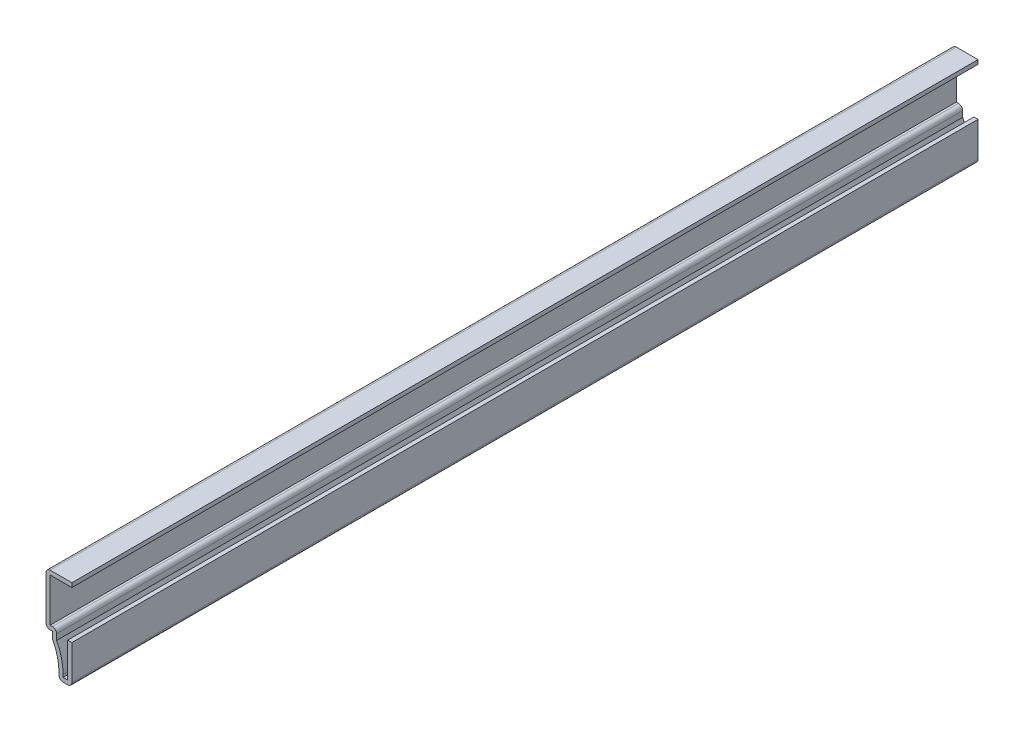
ISO-10303-21;
HEADER;
FILE_DESCRIPTION(('STEP AP214'),'2;1');
FILE_NAME('part.step','',(''),(''),'','','');
FILE_SCHEMA(('AUTOMOTIVE_DESIGN { 1 0 10303 214 1 1 1 1 }'));
ENDSEC;
DATA;
#1=APPLICATION_CONTEXT('core data for automotive mechanical design processes');
#2=APPLICATION_PROTOCOL_DEFINITION('international standard','automotive_design',2000,#1);
#3=PRODUCT_CONTEXT('',#1,'mechanical');
#4=PRODUCT('Part','Part','',(#3));
#5=PRODUCT_RELATED_PRODUCT_CATEGORY('part','',(#4));
#6=PRODUCT_DEFINITION_FORMATION('','',#4);
#7=PRODUCT_DEFINITION_CONTEXT('part definition',#1,'design');
#8=PRODUCT_DEFINITION('design','',#6,#7);
#9=PRODUCT_DEFINITION_SHAPE('','',#8);
#10=(LENGTH_UNIT() NAMED_UNIT(*) SI_UNIT(.MILLI.,.METRE.));
#11=(NAMED_UNIT(*) PLANE_ANGLE_UNIT() SI_UNIT($,.RADIAN.));
#12=(NAMED_UNIT(*) SI_UNIT($,.STERADIAN.) SOLID_ANGLE_UNIT());
#13=UNCERTAINTY_MEASURE_WITH_UNIT(LENGTH_MEASURE(1.E-05),#10,'distance_accuracy_value','');
#14=(GEOMETRIC_REPRESENTATION_CONTEXT(3) GLOBAL_UNCERTAINTY_ASSIGNED_CONTEXT((#13)) GLOBAL_UNIT_ASSIGNED_CONTEXT((#10,
#11,#12)) REPRESENTATION_CONTEXT('',''));
#15=CARTESIAN_POINT('',(0.,0.,0.));
#16=DIRECTION('',(0.,0.,1.));
#17=DIRECTION('',(1.,0.,0.));
#18=AXIS2_PLACEMENT_3D('',#15,#16,#17);
#19=CARTESIAN_POINT('',(-6.34999999999999,11.684,-222.25));
#20=DIRECTION('',(0.,-1.,0.));
#21=DIRECTION('',(0.,0.,-1.));
#22=AXIS2_PLACEMENT_3D('',#19,#20,#21);
#23=PLANE('',#22);
#24=DIRECTION('',(1.,0.,0.));
#25=VECTOR('',#24,1.);
#26=CARTESIAN_POINT('',(-6.34999999999999,11.684,0.));
#27=LINE('',#26,#25);
#28=CARTESIAN_POINT('',(-5.334,11.684,0.));
#29=VERTEX_POINT('',#28);
#30=CARTESIAN_POINT('',(0.,11.684,0.));
#31=VERTEX_POINT('',#30);
#32=EDGE_CURVE('E264',#29,#31,#27,.T.);
#33=ORIENTED_EDGE('',*,*,#32,.F.);
#34=DIRECTION('',(0.,0.,1.));
#35=VECTOR('',#34,1.);
#36=CARTESIAN_POINT('',(-5.334,11.684,-222.25));
#37=LINE('',#36,#35);
#38=CARTESIAN_POINT('',(-5.334,11.684,-222.25));
#39=VERTEX_POINT('',#38);
#40=EDGE_CURVE('E220',#39,#29,#37,.T.);
#41=ORIENTED_EDGE('',*,*,#40,.F.);
#42=DIRECTION('',(1.,0.,0.));
#43=VECTOR('',#42,1.);
#44=CARTESIAN_POINT('',(-6.34999999999999,11.684,-222.25));
#45=LINE('',#44,#43);
#46=CARTESIAN_POINT('',(0.,11.684,-222.25));
#47=VERTEX_POINT('',#46);
#48=EDGE_CURVE('E202',#39,#47,#45,.T.);
#49=ORIENTED_EDGE('',*,*,#48,.T.);
#50=DIRECTION('',(0.,0.,1.));
#51=VECTOR('',#50,1.);
#52=CARTESIAN_POINT('',(0.,11.684,-222.25));
#53=LINE('',#52,#51);
#54=EDGE_CURVE('E210',#47,#31,#53,.T.);
#55=ORIENTED_EDGE('',*,*,#54,.T.);
#56=EDGE_LOOP('',(#33,#41,#49,#55));
#57=FACE_BOUND('',#56,.T.);
#58=ADVANCED_FACE('F35',(#57),#23,.T.);
#59=CARTESIAN_POINT('',(-5.334,0.,-222.25));
#60=DIRECTION('',(1.,0.,0.));
#61=DIRECTION('',(0.,0.,-1.));
#62=AXIS2_PLACEMENT_3D('',#59,#60,#61);
#63=PLANE('',#62);
#64=DIRECTION('',(0.,1.,0.));
#65=VECTOR('',#64,1.);
#66=CARTESIAN_POINT('',(-5.334,0.,0.));
#67=LINE('',#66,#65);
#68=CARTESIAN_POINT('',(-5.334,1.016,0.));
#69=VERTEX_POINT('',#68);
#70=EDGE_CURVE('E221',#69,#29,#67,.T.);
#71=ORIENTED_EDGE('',*,*,#70,.F.);
#72=DIRECTION('',(0.,0.,1.));
#73=VECTOR('',#72,1.);
#74=CARTESIAN_POINT('',(-5.334,1.016,-222.25));
#75=LINE('',#74,#73);
#76=CARTESIAN_POINT('',(-5.334,1.016,-222.25));
#77=VERTEX_POINT('',#76);
#78=EDGE_CURVE('E308',#77,#69,#75,.T.);
#79=ORIENTED_EDGE('',*,*,#78,.F.);
#80=DIRECTION('',(0.,1.,0.));
#81=VECTOR('',#80,1.);
#82=CARTESIAN_POINT('',(-5.334,0.,-222.25));
#83=LINE('',#82,#81);
#84=EDGE_CURVE('E218',#77,#39,#83,.T.);
#85=ORIENTED_EDGE('',*,*,#84,.T.);
#86=ORIENTED_EDGE('',*,*,#40,.T.);
#87=EDGE_LOOP('',(#71,#79,#85,#86));
#88=FACE_BOUND('',#87,.T.);
#89=ADVANCED_FACE('F438',(#88),#63,.T.);
#90=CARTESIAN_POINT('',(-4.7625,1.016,-222.25));
#91=DIRECTION('',(0.,1.,0.));
#92=DIRECTION('',(-1.,0.,0.));
#93=AXIS2_PLACEMENT_3D('',#90,#91,#92);
#94=PLANE('',#93);
#95=DIRECTION('',(-1.,0.,0.));
#96=VECTOR('',#95,1.);
#97=CARTESIAN_POINT('',(-4.7625,1.016,0.));
#98=LINE('',#97,#96);
#99=CARTESIAN_POINT('',(-4.7625,1.016,0.));
#100=VERTEX_POINT('',#99);
#101=EDGE_CURVE('E224',#100,#69,#98,.T.);
#102=ORIENTED_EDGE('',*,*,#101,.F.);
#103=DIRECTION('',(0.,0.,1.));
#104=VECTOR('',#103,1.);
#105=CARTESIAN_POINT('',(-4.7625,1.016,-222.25));
#106=LINE('',#105,#104);
#107=CARTESIAN_POINT('',(-4.7625,1.016,-222.25));
#108=VERTEX_POINT('',#107);
#109=EDGE_CURVE('E362',#100,#108,#106,.F.);
#110=ORIENTED_EDGE('',*,*,#109,.T.);
#111=DIRECTION('',(-1.,0.,0.));
#112=VECTOR('',#111,1.);
#113=CARTESIAN_POINT('',(-4.7625,1.016,-222.25));
#114=LINE('',#113,#112);
#115=EDGE_CURVE('E261',#108,#77,#114,.T.);
#116=ORIENTED_EDGE('',*,*,#115,.T.);
#117=ORIENTED_EDGE('',*,*,#78,.T.);
#118=EDGE_LOOP('',(#102,#110,#116,#117));
#119=FACE_BOUND('',#118,.T.);
#120=ADVANCED_FACE('F481',(#119),#94,.T.);
#121=CARTESIAN_POINT('',(-3.7465,-1.68831946894786,-222.25));
#122=DIRECTION('',(1.,0.,0.));
#123=DIRECTION('',(0.,0.,-1.));
#124=AXIS2_PLACEMENT_3D('',#121,#122,#123);
#125=PLANE('',#124);
#126=DIRECTION('',(0.,1.,0.));
#127=VECTOR('',#126,1.);
#128=CARTESIAN_POINT('',(-3.7465,-1.68831946894786,-222.25));
#129=LINE('',#128,#127);
#130=CARTESIAN_POINT('',(-3.7465,-1.43135901297047,-222.25));
#131=VERTEX_POINT('',#130);
#132=CARTESIAN_POINT('',(-3.7465,0.,-222.25));
#133=VERTEX_POINT('',#132);
#134=EDGE_CURVE('E258',#131,#133,#129,.T.);
#135=ORIENTED_EDGE('',*,*,#134,.T.);
#136=DIRECTION('',(0.,0.,1.));
#137=VECTOR('',#136,1.);
#138=CARTESIAN_POINT('',(-3.7465,0.,-222.25));
#139=LINE('',#138,#137);
#140=CARTESIAN_POINT('',(-3.7465,0.,0.));
#141=VERTEX_POINT('',#140);
#142=EDGE_CURVE('E359',#133,#141,#139,.T.);
#143=ORIENTED_EDGE('',*,*,#142,.T.);
#144=DIRECTION('',(0.,1.,0.));
#145=VECTOR('',#144,1.);
#146=CARTESIAN_POINT('',(-3.7465,-1.68831946894786,0.));
#147=LINE('',#146,#145);
#148=CARTESIAN_POINT('',(-3.7465,-1.43135901297047,0.));
#149=VERTEX_POINT('',#148);
#150=EDGE_CURVE('E302',#149,#141,#147,.T.);
#151=ORIENTED_EDGE('',*,*,#150,.F.);
#152=DIRECTION('',(0.,0.,1.));
#153=VECTOR('',#152,1.);
#154=CARTESIAN_POINT('',(-3.7465,-1.43135901297047,-222.25));
#155=LINE('',#154,#153);
#156=EDGE_CURVE('E311',#131,#149,#155,.T.);
#157=ORIENTED_EDGE('',*,*,#156,.F.);
#158=EDGE_LOOP('',(#135,#143,#151,#157));
#159=FACE_BOUND('',#158,.T.);
#160=ADVANCED_FACE('F449',(#159),#125,.T.);
#161=CARTESIAN_POINT('',(-15.875,-7.83668053105214,-222.25));
#162=DIRECTION('',(0.,0.,1.));
#163=DIRECTION('',(1.,0.,0.));
#164=AXIS2_PLACEMENT_3D('',#161,#162,#163);
#165=CYLINDRICAL_SURFACE('',#164,13.716);
#166=CARTESIAN_POINT('',(-15.875,-7.83668053105214,0.));
#167=DIRECTION('',(0.,0.,1.));
#168=DIRECTION('',(1.,0.,0.));
#169=AXIS2_PLACEMENT_3D('',#166,#167,#168);
#170=CIRCLE('',#169,13.716);
#171=CARTESIAN_POINT('',(-2.159,-7.83668053105214,0.));
#172=VERTEX_POINT('',#171);
#173=EDGE_CURVE('E299',#172,#149,#170,.T.);
#174=ORIENTED_EDGE('',*,*,#173,.F.);
#175=DIRECTION('',(0.,0.,1.));
#176=VECTOR('',#175,1.);
#177=CARTESIAN_POINT('',(-2.159,-7.83668053105214,-222.25));
#178=LINE('',#177,#176);
#179=CARTESIAN_POINT('',(-2.159,-7.83668053105214,-222.25));
#180=VERTEX_POINT('',#179);
#181=EDGE_CURVE('E313',#180,#172,#178,.T.);
#182=ORIENTED_EDGE('',*,*,#181,.F.);
#183=CARTESIAN_POINT('',(-15.875,-7.83668053105214,-222.25));
#184=DIRECTION('',(0.,0.,1.));
#185=DIRECTION('',(1.,0.,0.));
#186=AXIS2_PLACEMENT_3D('',#183,#184,#185);
#187=CIRCLE('',#186,13.716);
#188=EDGE_CURVE('E255',#180,#131,#187,.T.);
#189=ORIENTED_EDGE('',*,*,#188,.T.);
#190=ORIENTED_EDGE('',*,*,#156,.T.);
#191=EDGE_LOOP('',(#174,#182,#189,#190));
#192=FACE_BOUND('',#191,.T.);
#193=ADVANCED_FACE('F453',(#192),#165,.T.);
#194=CARTESIAN_POINT('',(-2.159,-9.525,-222.25));
#195=DIRECTION('',(1.,0.,0.));
#196=DIRECTION('',(0.,0.,-1.));
#197=AXIS2_PLACEMENT_3D('',#194,#195,#196);
#198=PLANE('',#197);
#199=DIRECTION('',(0.,1.,0.));
#200=VECTOR('',#199,1.);
#201=CARTESIAN_POINT('',(-2.159,-9.525,0.));
#202=LINE('',#201,#200);
#203=CARTESIAN_POINT('',(-2.159,-8.509,0.));
#204=VERTEX_POINT('',#203);
#205=EDGE_CURVE('E296',#204,#172,#202,.T.);
#206=ORIENTED_EDGE('',*,*,#205,.F.);
#207=DIRECTION('',(0.,0.,1.));
#208=VECTOR('',#207,1.);
#209=CARTESIAN_POINT('',(-2.159,-8.509,-222.25));
#210=LINE('',#209,#208);
#211=CARTESIAN_POINT('',(-2.159,-8.509,-222.25));
#212=VERTEX_POINT('',#211);
#213=EDGE_CURVE('E315',#212,#204,#210,.T.);
#214=ORIENTED_EDGE('',*,*,#213,.F.);
#215=DIRECTION('',(0.,1.,0.));
#216=VECTOR('',#215,1.);
#217=CARTESIAN_POINT('',(-2.159,-9.525,-222.25));
#218=LINE('',#217,#216);
#219=EDGE_CURVE('E252',#212,#180,#218,.T.);
#220=ORIENTED_EDGE('',*,*,#219,.T.);
#221=ORIENTED_EDGE('',*,*,#181,.T.);
#222=EDGE_LOOP('',(#206,#214,#220,#221));
#223=FACE_BOUND('',#222,.T.);
#224=ADVANCED_FACE('F458',(#223),#198,.T.);
#225=CARTESIAN_POINT('',(0.,-8.509,-222.25));
#226=DIRECTION('',(0.,1.,0.));
#227=DIRECTION('',(-1.,0.,0.));
#228=AXIS2_PLACEMENT_3D('',#225,#226,#227);
#229=PLANE('',#228);
#230=DIRECTION('',(-1.,0.,0.));
#231=VECTOR('',#230,1.);
#232=CARTESIAN_POINT('',(0.,-8.509,0.));
#233=LINE('',#232,#231);
#234=CARTESIAN_POINT('',(-1.016,-8.509,0.));
#235=VERTEX_POINT('',#234);
#236=EDGE_CURVE('E293',#235,#204,#233,.T.);
#237=ORIENTED_EDGE('',*,*,#236,.F.);
#238=DIRECTION('',(0.,0.,1.));
#239=VECTOR('',#238,1.);
#240=CARTESIAN_POINT('',(-1.016,-8.509,-222.25));
#241=LINE('',#240,#239);
#242=CARTESIAN_POINT('',(-1.016,-8.509,-222.25));
#243=VERTEX_POINT('',#242);
#244=EDGE_CURVE('E317',#243,#235,#241,.T.);
#245=ORIENTED_EDGE('',*,*,#244,.F.);
#246=DIRECTION('',(-1.,0.,0.));
#247=VECTOR('',#246,1.);
#248=CARTESIAN_POINT('',(0.,-8.509,-222.25));
#249=LINE('',#248,#247);
#250=EDGE_CURVE('E249',#243,#212,#249,.T.);
#251=ORIENTED_EDGE('',*,*,#250,.T.);
#252=ORIENTED_EDGE('',*,*,#213,.T.);
#253=EDGE_LOOP('',(#237,#245,#251,#252));
#254=FACE_BOUND('',#253,.T.);
#255=ADVANCED_FACE('F461',(#254),#229,.T.);
#256=CARTESIAN_POINT('',(-1.016,0.,-222.25));
#257=DIRECTION('',(-1.,0.,0.));
#258=DIRECTION('',(0.,0.,1.));
#259=AXIS2_PLACEMENT_3D('',#256,#257,#258);
#260=PLANE('',#259);
#261=DIRECTION('',(0.,1.,0.));
#262=VECTOR('',#261,1.);
#263=CARTESIAN_POINT('',(-1.016,0.,0.));
#264=LINE('',#263,#262);
#265=CARTESIAN_POINT('',(-1.016,0.,0.));
#266=VERTEX_POINT('',#265);
#267=EDGE_CURVE('E290',#266,#235,#264,.F.);
#268=ORIENTED_EDGE('',*,*,#267,.F.);
#269=DIRECTION('',(0.,0.,1.));
#270=VECTOR('',#269,1.);
#271=CARTESIAN_POINT('',(-1.016,0.,-222.25));
#272=LINE('',#271,#270);
#273=CARTESIAN_POINT('',(-1.016,0.,-222.25));
#274=VERTEX_POINT('',#273);
#275=EDGE_CURVE('E319',#274,#266,#272,.T.);
#276=ORIENTED_EDGE('',*,*,#275,.F.);
#277=DIRECTION('',(0.,1.,0.));
#278=VECTOR('',#277,1.);
#279=CARTESIAN_POINT('',(-1.016,0.,-222.25));
#280=LINE('',#279,#278);
#281=EDGE_CURVE('E246',#274,#243,#280,.F.);
#282=ORIENTED_EDGE('',*,*,#281,.T.);
#283=ORIENTED_EDGE('',*,*,#244,.T.);
#284=EDGE_LOOP('',(#268,#276,#282,#283));
#285=FACE_BOUND('',#284,.T.);
#286=ADVANCED_FACE('F464',(#285),#260,.T.);
#287=CARTESIAN_POINT('',(-1.016,0.,-222.25));
#288=DIRECTION('',(0.,-1.,0.));
#289=DIRECTION('',(0.,0.,-1.));
#290=AXIS2_PLACEMENT_3D('',#287,#288,#289);
#291=PLANE('',#290);
#292=DIRECTION('',(1.,0.,0.));
#293=VECTOR('',#292,1.);
#294=CARTESIAN_POINT('',(-1.016,0.,0.));
#295=LINE('',#294,#293);
#296=CARTESIAN_POINT('',(0.,0.,0.));
#297=VERTEX_POINT('',#296);
#298=EDGE_CURVE('E288',#266,#297,#295,.T.);
#299=ORIENTED_EDGE('',*,*,#298,.T.);
#300=DIRECTION('',(0.,0.,1.));
#301=VECTOR('',#300,1.);
#302=CARTESIAN_POINT('',(0.,0.,-222.25));
#303=LINE('',#302,#301);
#304=CARTESIAN_POINT('',(0.,0.,-222.25));
#305=VERTEX_POINT('',#304);
#306=EDGE_CURVE('E321',#305,#297,#303,.T.);
#307=ORIENTED_EDGE('',*,*,#306,.F.);
#308=DIRECTION('',(1.,0.,0.));
#309=VECTOR('',#308,1.);
#310=CARTESIAN_POINT('',(-1.016,0.,-222.25));
#311=LINE('',#310,#309);
#312=EDGE_CURVE('E244',#274,#305,#311,.T.);
#313=ORIENTED_EDGE('',*,*,#312,.F.);
#314=ORIENTED_EDGE('',*,*,#275,.T.);
#315=EDGE_LOOP('',(#299,#307,#313,#314));
#316=FACE_BOUND('',#315,.T.);
#317=ADVANCED_FACE('F467',(#316),#291,.F.);
#318=CARTESIAN_POINT('',(0.,0.,-222.25));
#319=DIRECTION('',(-1.,0.,0.));
#320=DIRECTION('',(0.,0.,1.));
#321=AXIS2_PLACEMENT_3D('',#318,#319,#320);
#322=PLANE('',#321);
#323=DIRECTION('',(0.,-1.,0.));
#324=VECTOR('',#323,1.);
#325=CARTESIAN_POINT('',(0.,0.,0.));
#326=LINE('',#325,#324);
#327=CARTESIAN_POINT('',(0.,-8.509,0.));
#328=VERTEX_POINT('',#327);
#329=EDGE_CURVE('E285',#297,#328,#326,.T.);
#330=ORIENTED_EDGE('',*,*,#329,.T.);
#331=DIRECTION('',(0.,0.,1.));
#332=VECTOR('',#331,1.);
#333=CARTESIAN_POINT('',(0.,-8.509,-222.25));
#334=LINE('',#333,#332);
#335=CARTESIAN_POINT('',(0.,-8.509,-222.25));
#336=VERTEX_POINT('',#335);
#337=EDGE_CURVE('E43',#328,#336,#334,.F.);
#338=ORIENTED_EDGE('',*,*,#337,.T.);
#339=DIRECTION('',(0.,-1.,0.));
#340=VECTOR('',#339,1.);
#341=CARTESIAN_POINT('',(0.,0.,-222.25));
#342=LINE('',#341,#340);
#343=EDGE_CURVE('E241',#305,#336,#342,.T.);
#344=ORIENTED_EDGE('',*,*,#343,.F.);
#345=ORIENTED_EDGE('',*,*,#306,.T.);
#346=EDGE_LOOP('',(#330,#338,#344,#345));
#347=FACE_BOUND('',#346,.T.);
#348=ADVANCED_FACE('F379',(#347),#322,.F.);
#349=CARTESIAN_POINT('',(0.,-9.525,-222.25));
#350=DIRECTION('',(0.,1.,0.));
#351=DIRECTION('',(-1.,0.,0.));
#352=AXIS2_PLACEMENT_3D('',#349,#350,#351);
#353=PLANE('',#352);
#354=DIRECTION('',(-1.,0.,0.));
#355=VECTOR('',#354,1.);
#356=CARTESIAN_POINT('',(0.,-9.525,0.));
#357=LINE('',#356,#355);
#358=CARTESIAN_POINT('',(-1.016,-9.525,0.));
#359=VERTEX_POINT('',#358);
#360=CARTESIAN_POINT('',(-2.159,-9.525,0.));
#361=VERTEX_POINT('',#360);
#362=EDGE_CURVE('E282',#359,#361,#357,.T.);
#363=ORIENTED_EDGE('',*,*,#362,.T.);
#364=DIRECTION('',(0.,0.,1.));
#365=VECTOR('',#364,1.);
#366=CARTESIAN_POINT('',(-2.159,-9.525,-222.25));
#367=LINE('',#366,#365);
#368=CARTESIAN_POINT('',(-2.159,-9.525,-222.25));
#369=VERTEX_POINT('',#368);
#370=EDGE_CURVE('E375',#361,#369,#367,.F.);
#371=ORIENTED_EDGE('',*,*,#370,.T.);
#372=DIRECTION('',(-1.,0.,0.));
#373=VECTOR('',#372,1.);
#374=CARTESIAN_POINT('',(0.,-9.525,-222.25));
#375=LINE('',#374,#373);
#376=CARTESIAN_POINT('',(-1.016,-9.525,-222.25));
#377=VERTEX_POINT('',#376);
#378=EDGE_CURVE('E238',#377,#369,#375,.T.);
#379=ORIENTED_EDGE('',*,*,#378,.F.);
#380=DIRECTION('',(0.,0.,1.));
#381=VECTOR('',#380,1.);
#382=CARTESIAN_POINT('',(-1.016,-9.525,-222.25));
#383=LINE('',#382,#381);
#384=EDGE_CURVE('E372',#377,#359,#383,.T.);
#385=ORIENTED_EDGE('',*,*,#384,.T.);
#386=EDGE_LOOP('',(#363,#371,#379,#385));
#387=FACE_BOUND('',#386,.T.);
#388=ADVANCED_FACE('F391',(#387),#353,.F.);
#389=CARTESIAN_POINT('',(-3.175,-9.525,-222.25));
#390=DIRECTION('',(1.,0.,0.));
#391=DIRECTION('',(0.,0.,-1.));
#392=AXIS2_PLACEMENT_3D('',#389,#390,#391);
#393=PLANE('',#392);
#394=DIRECTION('',(0.,1.,0.));
#395=VECTOR('',#394,1.);
#396=CARTESIAN_POINT('',(-3.175,-9.525,-222.25));
#397=LINE('',#396,#395);
#398=CARTESIAN_POINT('',(-3.175,-8.509,-222.25));
#399=VERTEX_POINT('',#398);
#400=CARTESIAN_POINT('',(-3.175,-7.83668053105214,-222.25));
#401=VERTEX_POINT('',#400);
#402=EDGE_CURVE('E236',#399,#401,#397,.T.);
#403=ORIENTED_EDGE('',*,*,#402,.F.);
#404=DIRECTION('',(0.,0.,1.));
#405=VECTOR('',#404,1.);
#406=CARTESIAN_POINT('',(-3.175,-8.509,-222.25));
#407=LINE('',#406,#405);
#408=CARTESIAN_POINT('',(-3.175,-8.509,0.));
#409=VERTEX_POINT('',#408);
#410=EDGE_CURVE('E369',#399,#409,#407,.T.);
#411=ORIENTED_EDGE('',*,*,#410,.T.);
#412=DIRECTION('',(0.,1.,0.));
#413=VECTOR('',#412,1.);
#414=CARTESIAN_POINT('',(-3.175,-9.525,0.));
#415=LINE('',#414,#413);
#416=CARTESIAN_POINT('',(-3.175,-7.83668053105214,0.));
#417=VERTEX_POINT('',#416);
#418=EDGE_CURVE('E280',#409,#417,#415,.T.);
#419=ORIENTED_EDGE('',*,*,#418,.T.);
#420=DIRECTION('',(0.,0.,1.));
#421=VECTOR('',#420,1.);
#422=CARTESIAN_POINT('',(-3.175,-7.83668053105214,-222.25));
#423=LINE('',#422,#421);
#424=EDGE_CURVE('E324',#401,#417,#423,.T.);
#425=ORIENTED_EDGE('',*,*,#424,.F.);
#426=EDGE_LOOP('',(#403,#411,#419,#425));
#427=FACE_BOUND('',#426,.T.);
#428=ADVANCED_FACE('F404',(#427),#393,.F.);
#429=CARTESIAN_POINT('',(-15.875,-7.83668053105214,-222.25));
#430=DIRECTION('',(0.,0.,1.));
#431=DIRECTION('',(1.,0.,0.));
#432=AXIS2_PLACEMENT_3D('',#429,#430,#431);
#433=CYLINDRICAL_SURFACE('',#432,12.7);
#434=CARTESIAN_POINT('',(-15.875,-7.83668053105214,0.));
#435=DIRECTION('',(0.,0.,1.));
#436=DIRECTION('',(1.,0.,0.));
#437=AXIS2_PLACEMENT_3D('',#434,#435,#436);
#438=CIRCLE('',#437,12.7);
#439=CARTESIAN_POINT('',(-4.64490740740741,-1.90582727356911,0.));
#440=VERTEX_POINT('',#439);
#441=EDGE_CURVE('E277',#417,#440,#438,.T.);
#442=ORIENTED_EDGE('',*,*,#441,.T.);
#443=DIRECTION('',(0.,0.,1.));
#444=VECTOR('',#443,1.);
#445=CARTESIAN_POINT('',(-4.64490740740741,-1.90582727356911,-222.25));
#446=LINE('',#445,#444);
#447=CARTESIAN_POINT('',(-4.64490740740741,-1.90582727356911,-222.25));
#448=VERTEX_POINT('',#447);
#449=EDGE_CURVE('E367',#440,#448,#446,.F.);
#450=ORIENTED_EDGE('',*,*,#449,.T.);
#451=CARTESIAN_POINT('',(-15.875,-7.83668053105214,-222.25));
#452=DIRECTION('',(0.,0.,1.));
#453=DIRECTION('',(1.,0.,0.));
#454=AXIS2_PLACEMENT_3D('',#451,#452,#453);
#455=CIRCLE('',#454,12.7);
#456=EDGE_CURVE('E234',#401,#448,#455,.T.);
#457=ORIENTED_EDGE('',*,*,#456,.F.);
#458=ORIENTED_EDGE('',*,*,#424,.T.);
#459=EDGE_LOOP('',(#442,#450,#457,#458));
#460=FACE_BOUND('',#459,.T.);
#461=ADVANCED_FACE('F578',(#460),#433,.F.);
#462=CARTESIAN_POINT('',(-4.7625,-1.68831946894786,-222.25));
#463=DIRECTION('',(1.,0.,0.));
#464=DIRECTION('',(0.,0.,-1.));
#465=AXIS2_PLACEMENT_3D('',#462,#463,#464);
#466=PLANE('',#465);
#467=DIRECTION('',(0.,1.,0.));
#468=VECTOR('',#467,1.);
#469=CARTESIAN_POINT('',(-4.7625,-1.68831946894786,-222.25));
#470=LINE('',#469,#468);
#471=CARTESIAN_POINT('',(-4.7625,-1.43135901297047,-222.25));
#472=VERTEX_POINT('',#471);
#473=CARTESIAN_POINT('',(-4.7625,0.,-222.25));
#474=VERTEX_POINT('',#473);
#475=EDGE_CURVE('E232',#472,#474,#470,.T.);
#476=ORIENTED_EDGE('',*,*,#475,.F.);
#477=DIRECTION('',(0.,0.,1.));
#478=VECTOR('',#477,1.);
#479=CARTESIAN_POINT('',(-4.7625,-1.43135901297047,-222.25));
#480=LINE('',#479,#478);
#481=CARTESIAN_POINT('',(-4.7625,-1.43135901297047,0.));
#482=VERTEX_POINT('',#481);
#483=EDGE_CURVE('E364',#472,#482,#480,.T.);
#484=ORIENTED_EDGE('',*,*,#483,.T.);
#485=DIRECTION('',(0.,1.,0.));
#486=VECTOR('',#485,1.);
#487=CARTESIAN_POINT('',(-4.7625,-1.68831946894786,0.));
#488=LINE('',#487,#486);
#489=CARTESIAN_POINT('',(-4.7625,0.,0.));
#490=VERTEX_POINT('',#489);
#491=EDGE_CURVE('E275',#482,#490,#488,.T.);
#492=ORIENTED_EDGE('',*,*,#491,.T.);
#493=DIRECTION('',(0.,0.,1.));
#494=VECTOR('',#493,1.);
#495=CARTESIAN_POINT('',(-4.7625,0.,-222.25));
#496=LINE('',#495,#494);
#497=EDGE_CURVE('E327',#474,#490,#496,.T.);
#498=ORIENTED_EDGE('',*,*,#497,.F.);
#499=EDGE_LOOP('',(#476,#484,#492,#498));
#500=FACE_BOUND('',#499,.T.);
#501=ADVANCED_FACE('F414',(#500),#466,.F.);
#502=CARTESIAN_POINT('',(-4.7625,0.,-222.25));
#503=DIRECTION('',(0.,1.,0.));
#504=DIRECTION('',(-1.,0.,0.));
#505=AXIS2_PLACEMENT_3D('',#502,#503,#504);
#506=PLANE('',#505);
#507=DIRECTION('',(-1.,0.,0.));
#508=VECTOR('',#507,1.);
#509=CARTESIAN_POINT('',(-4.7625,0.,0.));
#510=LINE('',#509,#508);
#511=CARTESIAN_POINT('',(-5.33399999999999,0.,0.));
#512=VERTEX_POINT('',#511);
#513=EDGE_CURVE('E272',#490,#512,#510,.T.);
#514=ORIENTED_EDGE('',*,*,#513,.T.);
#515=DIRECTION('',(0.,0.,1.));
#516=VECTOR('',#515,1.);
#517=CARTESIAN_POINT('',(-5.33399999999999,0.,-222.25));
#518=LINE('',#517,#516);
#519=CARTESIAN_POINT('',(-5.33399999999999,0.,-222.25));
#520=VERTEX_POINT('',#519);
#521=EDGE_CURVE('E347',#512,#520,#518,.F.);
#522=ORIENTED_EDGE('',*,*,#521,.T.);
#523=DIRECTION('',(-1.,0.,0.));
#524=VECTOR('',#523,1.);
#525=CARTESIAN_POINT('',(-4.7625,0.,-222.25));
#526=LINE('',#525,#524);
#527=EDGE_CURVE('E230',#474,#520,#526,.T.);
#528=ORIENTED_EDGE('',*,*,#527,.F.);
#529=ORIENTED_EDGE('',*,*,#497,.T.);
#530=EDGE_LOOP('',(#514,#522,#528,#529));
#531=FACE_BOUND('',#530,.T.);
#532=ADVANCED_FACE('F419',(#531),#506,.F.);
#533=CARTESIAN_POINT('',(-6.34999999999999,0.,-222.25));
#534=DIRECTION('',(1.,0.,0.));
#535=DIRECTION('',(0.,0.,-1.));
#536=AXIS2_PLACEMENT_3D('',#533,#534,#535);
#537=PLANE('',#536);
#538=DIRECTION('',(0.,1.,0.));
#539=VECTOR('',#538,1.);
#540=CARTESIAN_POINT('',(-6.34999999999999,0.,-222.25));
#541=LINE('',#540,#539);
#542=CARTESIAN_POINT('',(-6.34999999999999,1.016,-222.25));
#543=VERTEX_POINT('',#542);
#544=CARTESIAN_POINT('',(-6.34999999999999,11.684,-222.25));
#545=VERTEX_POINT('',#544);
#546=EDGE_CURVE('E228',#543,#545,#541,.T.);
#547=ORIENTED_EDGE('',*,*,#546,.F.);
#548=DIRECTION('',(0.,0.,1.));
#549=VECTOR('',#548,1.);
#550=CARTESIAN_POINT('',(-6.34999999999999,1.016,-222.25));
#551=LINE('',#550,#549);
#552=CARTESIAN_POINT('',(-6.34999999999999,1.016,0.));
#553=VERTEX_POINT('',#552);
#554=EDGE_CURVE('E332',#543,#553,#551,.T.);
#555=ORIENTED_EDGE('',*,*,#554,.T.);
#556=DIRECTION('',(0.,1.,0.));
#557=VECTOR('',#556,1.);
#558=CARTESIAN_POINT('',(-6.34999999999999,0.,0.));
#559=LINE('',#558,#557);
#560=CARTESIAN_POINT('',(-6.34999999999999,11.684,0.));
#561=VERTEX_POINT('',#560);
#562=EDGE_CURVE('E269',#553,#561,#559,.T.);
#563=ORIENTED_EDGE('',*,*,#562,.T.);
#564=DIRECTION('',(0.,0.,1.));
#565=VECTOR('',#564,1.);
#566=CARTESIAN_POINT('',(-6.34999999999999,11.684,-222.25));
#567=LINE('',#566,#565);
#568=EDGE_CURVE('E307',#561,#545,#567,.F.);
#569=ORIENTED_EDGE('',*,*,#568,.T.);
#570=EDGE_LOOP('',(#547,#555,#563,#569));
#571=FACE_BOUND('',#570,.T.);
#572=ADVANCED_FACE('F427',(#571),#537,.F.);
#573=CARTESIAN_POINT('',(-6.34999999999999,12.7,-222.25));
#574=DIRECTION('',(0.,-1.,0.));
#575=DIRECTION('',(0.,0.,-1.));
#576=AXIS2_PLACEMENT_3D('',#573,#574,#575);
#577=PLANE('',#576);
#578=DIRECTION('',(1.,0.,0.));
#579=VECTOR('',#578,1.);
#580=CARTESIAN_POINT('',(-6.34999999999999,12.7,-222.25));
#581=LINE('',#580,#579);
#582=CARTESIAN_POINT('',(-5.334,12.7,-222.25));
#583=VERTEX_POINT('',#582);
#584=CARTESIAN_POINT('',(0.,12.7,-222.25));
#585=VERTEX_POINT('',#584);
#586=EDGE_CURVE('E204',#583,#585,#581,.T.);
#587=ORIENTED_EDGE('',*,*,#586,.F.);
#588=DIRECTION('',(0.,0.,1.));
#589=VECTOR('',#588,1.);
#590=CARTESIAN_POINT('',(-5.334,12.7,-222.25));
#591=LINE('',#590,#589);
#592=CARTESIAN_POINT('',(-5.334,12.7,0.));
#593=VERTEX_POINT('',#592);
#594=EDGE_CURVE('E11',#583,#593,#591,.T.);
#595=ORIENTED_EDGE('',*,*,#594,.T.);
#596=DIRECTION('',(1.,0.,0.));
#597=VECTOR('',#596,1.);
#598=CARTESIAN_POINT('',(-6.34999999999999,12.7,0.));
#599=LINE('',#598,#597);
#600=CARTESIAN_POINT('',(0.,12.7,0.));
#601=VERTEX_POINT('',#600);
#602=EDGE_CURVE('E267',#593,#601,#599,.T.);
#603=ORIENTED_EDGE('',*,*,#602,.T.);
#604=DIRECTION('',(0.,0.,1.));
#605=VECTOR('',#604,1.);
#606=CARTESIAN_POINT('',(0.,12.7,-222.25));
#607=LINE('',#606,#605);
#608=EDGE_CURVE('E217',#585,#601,#607,.T.);
#609=ORIENTED_EDGE('',*,*,#608,.F.);
#610=EDGE_LOOP('',(#587,#595,#603,#609));
#611=FACE_BOUND('',#610,.T.);
#612=ADVANCED_FACE('F433',(#611),#577,.F.);
#613=CARTESIAN_POINT('',(0.,12.7,-222.25));
#614=DIRECTION('',(-1.,0.,0.));
#615=DIRECTION('',(0.,0.,1.));
#616=AXIS2_PLACEMENT_3D('',#613,#614,#615);
#617=PLANE('',#616);
#618=DIRECTION('',(0.,-1.,0.));
#619=VECTOR('',#618,1.);
#620=CARTESIAN_POINT('',(0.,12.7,0.));
#621=LINE('',#620,#619);
#622=EDGE_CURVE('E213',#601,#31,#621,.T.);
#623=ORIENTED_EDGE('',*,*,#622,.T.);
#624=ORIENTED_EDGE('',*,*,#54,.F.);
#625=DIRECTION('',(0.,-1.,0.));
#626=VECTOR('',#625,1.);
#627=CARTESIAN_POINT('',(0.,12.7,-222.25));
#628=LINE('',#627,#626);
#629=EDGE_CURVE('E196',#585,#47,#628,.T.);
#630=ORIENTED_EDGE('',*,*,#629,.F.);
#631=ORIENTED_EDGE('',*,*,#608,.T.);
#632=EDGE_LOOP('',(#623,#624,#630,#631));
#633=FACE_BOUND('',#632,.T.);
#634=ADVANCED_FACE('F211',(#633),#617,.F.);
#635=CARTESIAN_POINT('',(-15.875,-7.83668053105214,-222.25));
#636=DIRECTION('',(0.,0.,1.));
#637=DIRECTION('',(1.,0.,0.));
#638=AXIS2_PLACEMENT_3D('',#635,#636,#637);
#639=PLANE('',#638);
#640=ORIENTED_EDGE('',*,*,#527,.T.);
#641=CARTESIAN_POINT('',(-5.334,1.016,-222.25));
#642=DIRECTION('',(0.,0.,1.));
#643=DIRECTION('',(1.,0.,0.));
#644=AXIS2_PLACEMENT_3D('',#641,#642,#643);
#645=CIRCLE('',#644,1.016);
#646=EDGE_CURVE('E357',#520,#543,#645,.F.);
#647=ORIENTED_EDGE('',*,*,#646,.T.);
#648=ORIENTED_EDGE('',*,*,#546,.T.);
#649=CARTESIAN_POINT('',(-5.334,11.684,-222.25));
#650=DIRECTION('',(0.,0.,1.));
#651=DIRECTION('',(1.,0.,0.));
#652=AXIS2_PLACEMENT_3D('',#649,#650,#651);
#653=CIRCLE('',#652,1.016);
#654=EDGE_CURVE('E50',#545,#583,#653,.F.);
#655=ORIENTED_EDGE('',*,*,#654,.T.);
#656=ORIENTED_EDGE('',*,*,#586,.T.);
#657=ORIENTED_EDGE('',*,*,#629,.T.);
#658=ORIENTED_EDGE('',*,*,#48,.F.);
#659=ORIENTED_EDGE('',*,*,#84,.F.);
#660=ORIENTED_EDGE('',*,*,#115,.F.);
#661=CARTESIAN_POINT('',(-4.7625,0.,-222.25));
#662=DIRECTION('',(0.,0.,1.));
#663=DIRECTION('',(1.,0.,0.));
#664=AXIS2_PLACEMENT_3D('',#661,#662,#663);
#665=CIRCLE('',#664,1.016);
#666=EDGE_CURVE('E355',#108,#133,#665,.F.);
#667=ORIENTED_EDGE('',*,*,#666,.T.);
#668=ORIENTED_EDGE('',*,*,#134,.F.);
#669=ORIENTED_EDGE('',*,*,#188,.F.);
#670=ORIENTED_EDGE('',*,*,#219,.F.);
#671=ORIENTED_EDGE('',*,*,#250,.F.);
#672=ORIENTED_EDGE('',*,*,#281,.F.);
#673=ORIENTED_EDGE('',*,*,#312,.T.);
#674=ORIENTED_EDGE('',*,*,#343,.T.);
#675=CARTESIAN_POINT('',(-1.016,-8.509,-222.25));
#676=DIRECTION('',(0.,0.,1.));
#677=DIRECTION('',(1.,0.,0.));
#678=AXIS2_PLACEMENT_3D('',#675,#676,#677);
#679=CIRCLE('',#678,1.016);
#680=EDGE_CURVE('E350',#336,#377,#679,.F.);
#681=ORIENTED_EDGE('',*,*,#680,.T.);
#682=ORIENTED_EDGE('',*,*,#378,.T.);
#683=CARTESIAN_POINT('',(-2.159,-8.509,-222.25));
#684=DIRECTION('',(0.,0.,1.));
#685=DIRECTION('',(1.,0.,0.));
#686=AXIS2_PLACEMENT_3D('',#683,#684,#685);
#687=CIRCLE('',#686,1.016);
#688=EDGE_CURVE('E352',#369,#399,#687,.F.);
#689=ORIENTED_EDGE('',*,*,#688,.T.);
#690=ORIENTED_EDGE('',*,*,#402,.T.);
#691=ORIENTED_EDGE('',*,*,#456,.T.);
#692=CARTESIAN_POINT('',(-3.7465,-1.43135901297047,-222.25));
#693=DIRECTION('',(0.,0.,1.));
#694=DIRECTION('',(1.,0.,0.));
#695=AXIS2_PLACEMENT_3D('',#692,#693,#694);
#696=CIRCLE('',#695,1.016);
#697=EDGE_CURVE('E57',#448,#472,#696,.F.);
#698=ORIENTED_EDGE('',*,*,#697,.T.);
#699=ORIENTED_EDGE('',*,*,#475,.T.);
#700=EDGE_LOOP('',(#640,#647,#648,#655,#656,#657,#658,#659,#660,#667,#668,#669,#670,#671,#672,
#673,#674,#681,#682,#689,#690,#691,#698,#699));
#701=FACE_BOUND('',#700,.T.);
#702=ADVANCED_FACE('F199',(#701),#639,.F.);
#703=CARTESIAN_POINT('',(-15.875,-7.83668053105214,0.));
#704=DIRECTION('',(0.,0.,1.));
#705=DIRECTION('',(1.,0.,0.));
#706=AXIS2_PLACEMENT_3D('',#703,#704,#705);
#707=PLANE('',#706);
#708=ORIENTED_EDGE('',*,*,#562,.F.);
#709=CARTESIAN_POINT('',(-5.334,1.016,0.));
#710=DIRECTION('',(0.,0.,1.));
#711=DIRECTION('',(1.,0.,0.));
#712=AXIS2_PLACEMENT_3D('',#709,#710,#711);
#713=CIRCLE('',#712,1.016);
#714=EDGE_CURVE('E345',#553,#512,#713,.T.);
#715=ORIENTED_EDGE('',*,*,#714,.T.);
#716=ORIENTED_EDGE('',*,*,#513,.F.);
#717=ORIENTED_EDGE('',*,*,#491,.F.);
#718=CARTESIAN_POINT('',(-3.7465,-1.43135901297047,0.));
#719=DIRECTION('',(0.,0.,1.));
#720=DIRECTION('',(1.,0.,0.));
#721=AXIS2_PLACEMENT_3D('',#718,#719,#720);
#722=CIRCLE('',#721,1.016);
#723=EDGE_CURVE('E341',#482,#440,#722,.T.);
#724=ORIENTED_EDGE('',*,*,#723,.T.);
#725=ORIENTED_EDGE('',*,*,#441,.F.);
#726=ORIENTED_EDGE('',*,*,#418,.F.);
#727=CARTESIAN_POINT('',(-2.159,-8.509,0.));
#728=DIRECTION('',(0.,0.,1.));
#729=DIRECTION('',(1.,0.,0.));
#730=AXIS2_PLACEMENT_3D('',#727,#728,#729);
#731=CIRCLE('',#730,1.016);
#732=EDGE_CURVE('E339',#409,#361,#731,.T.);
#733=ORIENTED_EDGE('',*,*,#732,.T.);
#734=ORIENTED_EDGE('',*,*,#362,.F.);
#735=CARTESIAN_POINT('',(-1.016,-8.509,0.));
#736=DIRECTION('',(0.,0.,1.));
#737=DIRECTION('',(1.,0.,0.));
#738=AXIS2_PLACEMENT_3D('',#735,#736,#737);
#739=CIRCLE('',#738,1.016);
#740=EDGE_CURVE('E337',#359,#328,#739,.T.);
#741=ORIENTED_EDGE('',*,*,#740,.T.);
#742=ORIENTED_EDGE('',*,*,#329,.F.);
#743=ORIENTED_EDGE('',*,*,#298,.F.);
#744=ORIENTED_EDGE('',*,*,#267,.T.);
#745=ORIENTED_EDGE('',*,*,#236,.T.);
#746=ORIENTED_EDGE('',*,*,#205,.T.);
#747=ORIENTED_EDGE('',*,*,#173,.T.);
#748=ORIENTED_EDGE('',*,*,#150,.T.);
#749=CARTESIAN_POINT('',(-4.7625,0.,0.));
#750=DIRECTION('',(0.,0.,1.));
#751=DIRECTION('',(1.,0.,0.));
#752=AXIS2_PLACEMENT_3D('',#749,#750,#751);
#753=CIRCLE('',#752,1.016);
#754=EDGE_CURVE('E343',#141,#100,#753,.T.);
#755=ORIENTED_EDGE('',*,*,#754,.T.);
#756=ORIENTED_EDGE('',*,*,#101,.T.);
#757=ORIENTED_EDGE('',*,*,#70,.T.);
#758=ORIENTED_EDGE('',*,*,#32,.T.);
#759=ORIENTED_EDGE('',*,*,#622,.F.);
#760=ORIENTED_EDGE('',*,*,#602,.F.);
#761=CARTESIAN_POINT('',(-5.334,11.684,0.));
#762=DIRECTION('',(0.,0.,1.));
#763=DIRECTION('',(1.,0.,0.));
#764=AXIS2_PLACEMENT_3D('',#761,#762,#763);
#765=CIRCLE('',#764,1.016);
#766=EDGE_CURVE('E335',#593,#561,#765,.T.);
#767=ORIENTED_EDGE('',*,*,#766,.T.);
#768=EDGE_LOOP('',(#708,#715,#716,#717,#724,#725,#726,#733,#734,#741,#742,#743,#744,#745,#746,
#747,#748,#755,#756,#757,#758,#759,#760,#767));
#769=FACE_BOUND('',#768,.T.);
#770=ADVANCED_FACE('F395',(#769),#707,.T.);
#771=CARTESIAN_POINT('',(-5.334,1.016,-222.25));
#772=DIRECTION('',(0.,0.,1.));
#773=DIRECTION('',(1.,0.,0.));
#774=AXIS2_PLACEMENT_3D('',#771,#772,#773);
#775=CYLINDRICAL_SURFACE('',#774,1.016);
#776=ORIENTED_EDGE('',*,*,#646,.F.);
#777=ORIENTED_EDGE('',*,*,#521,.F.);
#778=ORIENTED_EDGE('',*,*,#714,.F.);
#779=ORIENTED_EDGE('',*,*,#554,.F.);
#780=EDGE_LOOP('',(#776,#777,#778,#779));
#781=FACE_BOUND('',#780,.T.);
#782=ADVANCED_FACE('F423',(#781),#775,.T.);
#783=CARTESIAN_POINT('',(-4.7625,0.,-222.25));
#784=DIRECTION('',(0.,0.,1.));
#785=DIRECTION('',(1.,0.,0.));
#786=AXIS2_PLACEMENT_3D('',#783,#784,#785);
#787=CYLINDRICAL_SURFACE('',#786,1.016);
#788=ORIENTED_EDGE('',*,*,#666,.F.);
#789=ORIENTED_EDGE('',*,*,#109,.F.);
#790=ORIENTED_EDGE('',*,*,#754,.F.);
#791=ORIENTED_EDGE('',*,*,#142,.F.);
#792=EDGE_LOOP('',(#788,#789,#790,#791));
#793=FACE_BOUND('',#792,.T.);
#794=ADVANCED_FACE('F446',(#793),#787,.T.);
#795=CARTESIAN_POINT('',(-3.7465,-1.43135901297047,-222.25));
#796=DIRECTION('',(0.,0.,1.));
#797=DIRECTION('',(1.,0.,0.));
#798=AXIS2_PLACEMENT_3D('',#795,#796,#797);
#799=CYLINDRICAL_SURFACE('',#798,1.016);
#800=ORIENTED_EDGE('',*,*,#697,.F.);
#801=ORIENTED_EDGE('',*,*,#449,.F.);
#802=ORIENTED_EDGE('',*,*,#723,.F.);
#803=ORIENTED_EDGE('',*,*,#483,.F.);
#804=EDGE_LOOP('',(#800,#801,#802,#803));
#805=FACE_BOUND('',#804,.T.);
#806=ADVANCED_FACE('F411',(#805),#799,.T.);
#807=CARTESIAN_POINT('',(-2.159,-8.509,-222.25));
#808=DIRECTION('',(0.,0.,1.));
#809=DIRECTION('',(1.,0.,0.));
#810=AXIS2_PLACEMENT_3D('',#807,#808,#809);
#811=CYLINDRICAL_SURFACE('',#810,1.016);
#812=ORIENTED_EDGE('',*,*,#688,.F.);
#813=ORIENTED_EDGE('',*,*,#370,.F.);
#814=ORIENTED_EDGE('',*,*,#732,.F.);
#815=ORIENTED_EDGE('',*,*,#410,.F.);
#816=EDGE_LOOP('',(#812,#813,#814,#815));
#817=FACE_BOUND('',#816,.T.);
#818=ADVANCED_FACE('F401',(#817),#811,.T.);
#819=CARTESIAN_POINT('',(-1.016,-8.509,-222.25));
#820=DIRECTION('',(0.,0.,1.));
#821=DIRECTION('',(1.,0.,0.));
#822=AXIS2_PLACEMENT_3D('',#819,#820,#821);
#823=CYLINDRICAL_SURFACE('',#822,1.016);
#824=ORIENTED_EDGE('',*,*,#680,.F.);
#825=ORIENTED_EDGE('',*,*,#337,.F.);
#826=ORIENTED_EDGE('',*,*,#740,.F.);
#827=ORIENTED_EDGE('',*,*,#384,.F.);
#828=EDGE_LOOP('',(#824,#825,#826,#827));
#829=FACE_BOUND('',#828,.T.);
#830=ADVANCED_FACE('F388',(#829),#823,.T.);
#831=CARTESIAN_POINT('',(-5.334,11.684,-222.25));
#832=DIRECTION('',(0.,0.,1.));
#833=DIRECTION('',(1.,0.,0.));
#834=AXIS2_PLACEMENT_3D('',#831,#832,#833);
#835=CYLINDRICAL_SURFACE('',#834,1.016);
#836=ORIENTED_EDGE('',*,*,#654,.F.);
#837=ORIENTED_EDGE('',*,*,#568,.F.);
#838=ORIENTED_EDGE('',*,*,#766,.F.);
#839=ORIENTED_EDGE('',*,*,#594,.F.);
#840=EDGE_LOOP('',(#836,#837,#838,#839));
#841=FACE_BOUND('',#840,.T.);
#842=ADVANCED_FACE('F37',(#841),#835,.T.);
#843=CLOSED_SHELL('',(#58,#89,#120,#160,#193,#224,#255,#286,#317,#348,#388,#428,#461,#501,#532,
#572,#612,#634,#702,#770,#782,#794,#806,#818,#830,#842));
#844=MANIFOLD_SOLID_BREP('B2',#843);
#845=ADVANCED_BREP_SHAPE_REPRESENTATION('',(#18,#844),#14);
#846=SHAPE_DEFINITION_REPRESENTATION(#9,#845);
ENDSEC;
END-ISO-10303-21;
